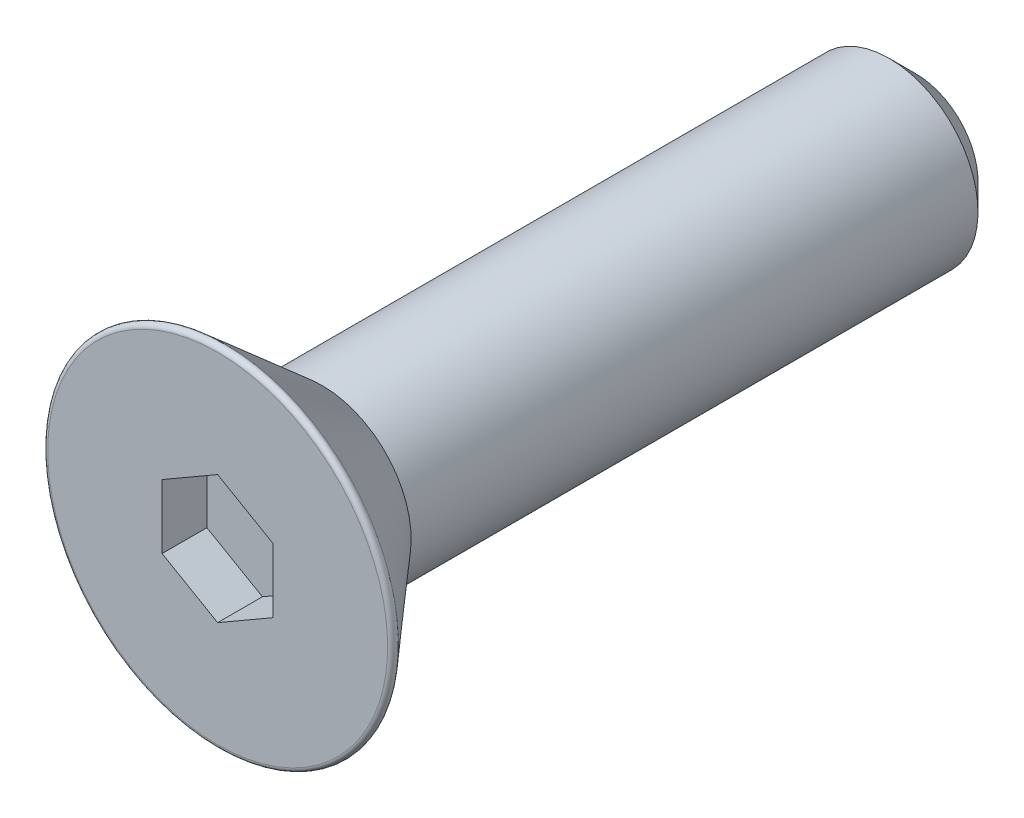
ISO-10303-21;
HEADER;
FILE_DESCRIPTION(('STEP AP214'),'2;1');
FILE_NAME('part.step','',(''),(''),'','','');
FILE_SCHEMA(('AUTOMOTIVE_DESIGN { 1 0 10303 214 1 1 1 1 }'));
ENDSEC;
DATA;
#1=APPLICATION_CONTEXT('core data for automotive mechanical design processes');
#2=APPLICATION_PROTOCOL_DEFINITION('international standard','automotive_design',2000,#1);
#3=PRODUCT_CONTEXT('',#1,'mechanical');
#4=PRODUCT('Part','Part','',(#3));
#5=PRODUCT_RELATED_PRODUCT_CATEGORY('part','',(#4));
#6=PRODUCT_DEFINITION_FORMATION('','',#4);
#7=PRODUCT_DEFINITION_CONTEXT('part definition',#1,'design');
#8=PRODUCT_DEFINITION('design','',#6,#7);
#9=PRODUCT_DEFINITION_SHAPE('','',#8);
#10=(LENGTH_UNIT() NAMED_UNIT(*) SI_UNIT(.MILLI.,.METRE.));
#11=(NAMED_UNIT(*) PLANE_ANGLE_UNIT() SI_UNIT($,.RADIAN.));
#12=(NAMED_UNIT(*) SI_UNIT($,.STERADIAN.) SOLID_ANGLE_UNIT());
#13=UNCERTAINTY_MEASURE_WITH_UNIT(LENGTH_MEASURE(1.E-05),#10,'distance_accuracy_value','');
#14=(GEOMETRIC_REPRESENTATION_CONTEXT(3) GLOBAL_UNCERTAINTY_ASSIGNED_CONTEXT((#13)) GLOBAL_UNIT_ASSIGNED_CONTEXT((#10,
#11,#12)) REPRESENTATION_CONTEXT('',''));
#15=CARTESIAN_POINT('',(0.,0.,0.));
#16=DIRECTION('',(0.,0.,1.));
#17=DIRECTION('',(1.,0.,0.));
#18=AXIS2_PLACEMENT_3D('',#15,#16,#17);
#19=CARTESIAN_POINT('',(0.,0.,8.51289226515041));
#20=DIRECTION('',(0.,0.,1.));
#21=DIRECTION('',(0.,-1.,0.));
#22=AXIS2_PLACEMENT_3D('',#19,#20,#21);
#23=CONICAL_SURFACE('',#22,3.17500000000001,0.715584993317677);
#24=CARTESIAN_POINT('',(0.,0.,11.9882962524221));
#25=DIRECTION('',(0.,0.,-1.));
#26=DIRECTION('',(0.,1.,0.));
#27=AXIS2_PLACEMENT_3D('',#24,#25,#26);
#28=CIRCLE('',#27,6.19612259468891);
#29=CARTESIAN_POINT('',(0.,6.19612259468891,11.9882962524221));
#30=VERTEX_POINT('',#29);
#31=EDGE_CURVE('E149',#30,#30,#28,.T.);
#32=ORIENTED_EDGE('',*,*,#31,.T.);
#33=EDGE_LOOP('',(#32));
#34=FACE_BOUND('',#33,.T.);
#35=CARTESIAN_POINT('',(0.,0.,8.51289226515041));
#36=DIRECTION('',(0.,0.,-1.));
#37=DIRECTION('',(0.,1.,0.));
#38=AXIS2_PLACEMENT_3D('',#35,#36,#37);
#39=CIRCLE('',#38,3.17500000000001);
#40=CARTESIAN_POINT('',(0.,3.17500000000001,8.51289226515041));
#41=VERTEX_POINT('',#40);
#42=EDGE_CURVE('E51',#41,#41,#39,.T.);
#43=ORIENTED_EDGE('',*,*,#42,.F.);
#44=EDGE_LOOP('',(#43));
#45=FACE_BOUND('',#44,.T.);
#46=ADVANCED_FACE('F44',(#34,#45),#23,.T.);
#47=CARTESIAN_POINT('',(0.,2.2225,-12.7));
#48=DIRECTION('',(0.,0.,-1.));
#49=DIRECTION('',(0.,1.,0.));
#50=AXIS2_PLACEMENT_3D('',#47,#48,#49);
#51=PLANE('',#50);
#52=CARTESIAN_POINT('',(0.,0.,-12.7));
#53=DIRECTION('',(0.,0.,-1.));
#54=DIRECTION('',(0.,1.,0.));
#55=AXIS2_PLACEMENT_3D('',#52,#53,#54);
#56=CIRCLE('',#55,2.2225);
#57=CARTESIAN_POINT('',(0.,2.2225,-12.7));
#58=VERTEX_POINT('',#57);
#59=EDGE_CURVE('E158',#58,#58,#56,.T.);
#60=ORIENTED_EDGE('',*,*,#59,.T.);
#61=EDGE_LOOP('',(#60));
#62=FACE_BOUND('',#61,.T.);
#63=ADVANCED_FACE('F181',(#62),#51,.T.);
#64=CARTESIAN_POINT('',(0.,0.,-12.7));
#65=DIRECTION('',(0.,0.,1.));
#66=DIRECTION('',(0.,-1.,0.));
#67=AXIS2_PLACEMENT_3D('',#64,#65,#66);
#68=CONICAL_SURFACE('',#67,2.2225,0.785398163397453);
#69=CARTESIAN_POINT('',(0.,0.,-11.7475));
#70=DIRECTION('',(0.,0.,-1.));
#71=DIRECTION('',(0.,1.,0.));
#72=AXIS2_PLACEMENT_3D('',#69,#70,#71);
#73=CIRCLE('',#72,3.17500000000001);
#74=CARTESIAN_POINT('',(0.,3.17500000000001,-11.7475));
#75=VERTEX_POINT('',#74);
#76=EDGE_CURVE('E104',#75,#75,#73,.T.);
#77=ORIENTED_EDGE('',*,*,#76,.T.);
#78=EDGE_LOOP('',(#77));
#79=FACE_BOUND('',#78,.T.);
#80=ORIENTED_EDGE('',*,*,#59,.F.);
#81=EDGE_LOOP('',(#80));
#82=FACE_BOUND('',#81,.T.);
#83=ADVANCED_FACE('F188',(#79,#82),#68,.T.);
#84=CARTESIAN_POINT('',(0.,0.,-12.7));
#85=DIRECTION('',(0.,0.,-1.));
#86=DIRECTION('',(0.,1.,0.));
#87=AXIS2_PLACEMENT_3D('',#84,#85,#86);
#88=CYLINDRICAL_SURFACE('',#87,3.17500000000001);
#89=ORIENTED_EDGE('',*,*,#42,.T.);
#90=EDGE_LOOP('',(#89));
#91=FACE_BOUND('',#90,.T.);
#92=ORIENTED_EDGE('',*,*,#76,.F.);
#93=EDGE_LOOP('',(#92));
#94=FACE_BOUND('',#93,.T.);
#95=ADVANCED_FACE('F201',(#91,#94),#88,.T.);
#96=CARTESIAN_POINT('',(0.,6.07435083134095,12.2555));
#97=DIRECTION('',(0.,0.,-1.));
#98=DIRECTION('',(0.,1.,0.));
#99=AXIS2_PLACEMENT_3D('',#96,#97,#98);
#100=PLANE('',#99);
#101=CARTESIAN_POINT('',(0.,0.,12.2555));
#102=DIRECTION('',(0.,0.,-1.));
#103=DIRECTION('',(0.,1.,0.));
#104=AXIS2_PLACEMENT_3D('',#101,#102,#103);
#105=CIRCLE('',#104,6.07435083134095);
#106=CARTESIAN_POINT('',(0.,6.07435083134095,12.2555));
#107=VERTEX_POINT('',#106);
#108=EDGE_CURVE('E144',#107,#107,#105,.T.);
#109=ORIENTED_EDGE('',*,*,#108,.F.);
#110=EDGE_LOOP('',(#109));
#111=FACE_BOUND('',#110,.T.);
#112=DIRECTION('',(0.866025403784439,-0.5,0.));
#113=VECTOR('',#112,1.);
#114=CARTESIAN_POINT('',(-1.984375,-1.14567944042316,12.2555));
#115=LINE('',#114,#113);
#116=CARTESIAN_POINT('',(-1.984375,-1.14567944042316,12.2555));
#117=VERTEX_POINT('',#116);
#118=CARTESIAN_POINT('',(0.,-2.29135888084633,12.2555));
#119=VERTEX_POINT('',#118);
#120=EDGE_CURVE('E105',#117,#119,#115,.T.);
#121=ORIENTED_EDGE('',*,*,#120,.F.);
#122=DIRECTION('',(0.,-1.,0.));
#123=VECTOR('',#122,1.);
#124=CARTESIAN_POINT('',(-1.984375,1.14567944042316,12.2555));
#125=LINE('',#124,#123);
#126=CARTESIAN_POINT('',(-1.984375,1.14567944042316,12.2555));
#127=VERTEX_POINT('',#126);
#128=EDGE_CURVE('E146',#127,#117,#125,.T.);
#129=ORIENTED_EDGE('',*,*,#128,.F.);
#130=DIRECTION('',(-0.866025403784439,-0.5,0.));
#131=VECTOR('',#130,1.);
#132=CARTESIAN_POINT('',(0.,2.29135888084633,12.2555));
#133=LINE('',#132,#131);
#134=CARTESIAN_POINT('',(0.,2.29135888084633,12.2555));
#135=VERTEX_POINT('',#134);
#136=EDGE_CURVE('E136',#135,#127,#133,.T.);
#137=ORIENTED_EDGE('',*,*,#136,.F.);
#138=DIRECTION('',(-0.866025403784439,0.5,0.));
#139=VECTOR('',#138,1.);
#140=CARTESIAN_POINT('',(1.984375,1.14567944042316,12.2555));
#141=LINE('',#140,#139);
#142=CARTESIAN_POINT('',(1.984375,1.14567944042316,12.2555));
#143=VERTEX_POINT('',#142);
#144=EDGE_CURVE('E58',#143,#135,#141,.T.);
#145=ORIENTED_EDGE('',*,*,#144,.F.);
#146=DIRECTION('',(0.,1.,0.));
#147=VECTOR('',#146,1.);
#148=CARTESIAN_POINT('',(1.984375,-1.14567944042316,12.2555));
#149=LINE('',#148,#147);
#150=CARTESIAN_POINT('',(1.984375,-1.14567944042316,12.2555));
#151=VERTEX_POINT('',#150);
#152=EDGE_CURVE('E12',#151,#143,#149,.T.);
#153=ORIENTED_EDGE('',*,*,#152,.F.);
#154=DIRECTION('',(0.866025403784439,0.5,0.));
#155=VECTOR('',#154,1.);
#156=CARTESIAN_POINT('',(0.,-2.29135888084633,12.2555));
#157=LINE('',#156,#155);
#158=EDGE_CURVE('E96',#119,#151,#157,.T.);
#159=ORIENTED_EDGE('',*,*,#158,.F.);
#160=EDGE_LOOP('',(#121,#129,#137,#145,#153,#159));
#161=FACE_BOUND('',#160,.T.);
#162=ADVANCED_FACE('F95',(#111,#161),#100,.F.);
#163=CARTESIAN_POINT('',(0.,0.,12.094150831341));
#164=DIRECTION('',(0.,0.,-1.));
#165=DIRECTION('',(0.,1.,0.));
#166=AXIS2_PLACEMENT_3D('',#163,#164,#165);
#167=TOROIDAL_SURFACE('',#166,6.07435083134095,0.161349168659044);
#168=ORIENTED_EDGE('',*,*,#31,.F.);
#169=EDGE_LOOP('',(#168));
#170=FACE_BOUND('',#169,.T.);
#171=ORIENTED_EDGE('',*,*,#108,.T.);
#172=EDGE_LOOP('',(#171));
#173=FACE_BOUND('',#172,.T.);
#174=ADVANCED_FACE('F195',(#170,#173),#167,.T.);
#175=CARTESIAN_POINT('',(0.,0.,10.6553));
#176=DIRECTION('',(0.,0.,1.));
#177=DIRECTION('',(1.,0.,0.));
#178=AXIS2_PLACEMENT_3D('',#175,#176,#177);
#179=PLANE('',#178);
#180=DIRECTION('',(0.866025403784439,0.5,0.));
#181=VECTOR('',#180,1.);
#182=CARTESIAN_POINT('',(0.,-2.29135888084633,10.6553));
#183=LINE('',#182,#181);
#184=CARTESIAN_POINT('',(0.,-2.29135888084633,10.6553));
#185=VERTEX_POINT('',#184);
#186=CARTESIAN_POINT('',(1.984375,-1.14567944042316,10.6553));
#187=VERTEX_POINT('',#186);
#188=EDGE_CURVE('E161',#185,#187,#183,.T.);
#189=ORIENTED_EDGE('',*,*,#188,.T.);
#190=DIRECTION('',(0.,1.,0.));
#191=VECTOR('',#190,1.);
#192=CARTESIAN_POINT('',(1.984375,-1.14567944042316,10.6553));
#193=LINE('',#192,#191);
#194=CARTESIAN_POINT('',(1.984375,1.14567944042316,10.6553));
#195=VERTEX_POINT('',#194);
#196=EDGE_CURVE('E109',#187,#195,#193,.T.);
#197=ORIENTED_EDGE('',*,*,#196,.T.);
#198=DIRECTION('',(-0.866025403784439,0.5,0.));
#199=VECTOR('',#198,1.);
#200=CARTESIAN_POINT('',(1.984375,1.14567944042316,10.6553));
#201=LINE('',#200,#199);
#202=CARTESIAN_POINT('',(0.,2.29135888084633,10.6553));
#203=VERTEX_POINT('',#202);
#204=EDGE_CURVE('E143',#195,#203,#201,.T.);
#205=ORIENTED_EDGE('',*,*,#204,.T.);
#206=DIRECTION('',(-0.866025403784439,-0.5,0.));
#207=VECTOR('',#206,1.);
#208=CARTESIAN_POINT('',(0.,2.29135888084633,10.6553));
#209=LINE('',#208,#207);
#210=CARTESIAN_POINT('',(-1.984375,1.14567944042316,10.6553));
#211=VERTEX_POINT('',#210);
#212=EDGE_CURVE('E138',#203,#211,#209,.T.);
#213=ORIENTED_EDGE('',*,*,#212,.T.);
#214=DIRECTION('',(0.,-1.,0.));
#215=VECTOR('',#214,1.);
#216=CARTESIAN_POINT('',(-1.984375,1.14567944042316,10.6553));
#217=LINE('',#216,#215);
#218=CARTESIAN_POINT('',(-1.984375,-1.14567944042316,10.6553));
#219=VERTEX_POINT('',#218);
#220=EDGE_CURVE('E117',#211,#219,#217,.T.);
#221=ORIENTED_EDGE('',*,*,#220,.T.);
#222=DIRECTION('',(0.866025403784439,-0.5,0.));
#223=VECTOR('',#222,1.);
#224=CARTESIAN_POINT('',(-1.984375,-1.14567944042316,10.6553));
#225=LINE('',#224,#223);
#226=EDGE_CURVE('E112',#219,#185,#225,.T.);
#227=ORIENTED_EDGE('',*,*,#226,.T.);
#228=EDGE_LOOP('',(#189,#197,#205,#213,#221,#227));
#229=FACE_BOUND('',#228,.T.);
#230=ADVANCED_FACE('F168',(#229),#179,.T.);
#231=CARTESIAN_POINT('',(1.984375,-1.14567944042316,10.6553));
#232=DIRECTION('',(1.,0.,0.));
#233=DIRECTION('',(0.,1.,0.));
#234=AXIS2_PLACEMENT_3D('',#231,#232,#233);
#235=PLANE('',#234);
#236=DIRECTION('',(0.,0.,1.));
#237=VECTOR('',#236,1.);
#238=CARTESIAN_POINT('',(1.984375,-1.14567944042316,10.6553));
#239=LINE('',#238,#237);
#240=EDGE_CURVE('E102',#187,#151,#239,.T.);
#241=ORIENTED_EDGE('',*,*,#240,.T.);
#242=ORIENTED_EDGE('',*,*,#152,.T.);
#243=DIRECTION('',(0.,0.,1.));
#244=VECTOR('',#243,1.);
#245=CARTESIAN_POINT('',(1.984375,1.14567944042316,10.6553));
#246=LINE('',#245,#244);
#247=EDGE_CURVE('E111',#195,#143,#246,.T.);
#248=ORIENTED_EDGE('',*,*,#247,.F.);
#249=ORIENTED_EDGE('',*,*,#196,.F.);
#250=EDGE_LOOP('',(#241,#242,#248,#249));
#251=FACE_BOUND('',#250,.T.);
#252=ADVANCED_FACE('F107',(#251),#235,.F.);
#253=CARTESIAN_POINT('',(1.984375,1.14567944042316,10.6553));
#254=DIRECTION('',(0.5,0.866025403784439,0.));
#255=DIRECTION('',(-0.866025403784439,0.5,0.));
#256=AXIS2_PLACEMENT_3D('',#253,#254,#255);
#257=PLANE('',#256);
#258=ORIENTED_EDGE('',*,*,#247,.T.);
#259=ORIENTED_EDGE('',*,*,#144,.T.);
#260=DIRECTION('',(0.,0.,1.));
#261=VECTOR('',#260,1.);
#262=CARTESIAN_POINT('',(0.,2.29135888084633,10.6553));
#263=LINE('',#262,#261);
#264=EDGE_CURVE('E114',#203,#135,#263,.T.);
#265=ORIENTED_EDGE('',*,*,#264,.F.);
#266=ORIENTED_EDGE('',*,*,#204,.F.);
#267=EDGE_LOOP('',(#258,#259,#265,#266));
#268=FACE_BOUND('',#267,.T.);
#269=ADVANCED_FACE('F142',(#268),#257,.F.);
#270=CARTESIAN_POINT('',(0.,2.29135888084633,10.6553));
#271=DIRECTION('',(-0.5,0.866025403784439,0.));
#272=DIRECTION('',(-0.866025403784439,-0.5,0.));
#273=AXIS2_PLACEMENT_3D('',#270,#271,#272);
#274=PLANE('',#273);
#275=ORIENTED_EDGE('',*,*,#264,.T.);
#276=ORIENTED_EDGE('',*,*,#136,.T.);
#277=DIRECTION('',(0.,0.,1.));
#278=VECTOR('',#277,1.);
#279=CARTESIAN_POINT('',(-1.984375,1.14567944042316,10.6553));
#280=LINE('',#279,#278);
#281=EDGE_CURVE('E126',#211,#127,#280,.T.);
#282=ORIENTED_EDGE('',*,*,#281,.F.);
#283=ORIENTED_EDGE('',*,*,#212,.F.);
#284=EDGE_LOOP('',(#275,#276,#282,#283));
#285=FACE_BOUND('',#284,.T.);
#286=ADVANCED_FACE('F135',(#285),#274,.F.);
#287=CARTESIAN_POINT('',(-1.984375,1.14567944042316,10.6553));
#288=DIRECTION('',(-1.,0.,0.));
#289=DIRECTION('',(0.,0.,1.));
#290=AXIS2_PLACEMENT_3D('',#287,#288,#289);
#291=PLANE('',#290);
#292=ORIENTED_EDGE('',*,*,#281,.T.);
#293=ORIENTED_EDGE('',*,*,#128,.T.);
#294=DIRECTION('',(0.,0.,1.));
#295=VECTOR('',#294,1.);
#296=CARTESIAN_POINT('',(-1.984375,-1.14567944042316,10.6553));
#297=LINE('',#296,#295);
#298=EDGE_CURVE('E123',#219,#117,#297,.T.);
#299=ORIENTED_EDGE('',*,*,#298,.F.);
#300=ORIENTED_EDGE('',*,*,#220,.F.);
#301=EDGE_LOOP('',(#292,#293,#299,#300));
#302=FACE_BOUND('',#301,.T.);
#303=ADVANCED_FACE('F171',(#302),#291,.F.);
#304=CARTESIAN_POINT('',(-1.984375,-1.14567944042316,10.6553));
#305=DIRECTION('',(-0.5,-0.866025403784439,0.));
#306=DIRECTION('',(0.866025403784439,-0.5,0.));
#307=AXIS2_PLACEMENT_3D('',#304,#305,#306);
#308=PLANE('',#307);
#309=ORIENTED_EDGE('',*,*,#298,.T.);
#310=ORIENTED_EDGE('',*,*,#120,.T.);
#311=DIRECTION('',(0.,0.,1.));
#312=VECTOR('',#311,1.);
#313=CARTESIAN_POINT('',(0.,-2.29135888084633,10.6553));
#314=LINE('',#313,#312);
#315=EDGE_CURVE('E65',#185,#119,#314,.T.);
#316=ORIENTED_EDGE('',*,*,#315,.F.);
#317=ORIENTED_EDGE('',*,*,#226,.F.);
#318=EDGE_LOOP('',(#309,#310,#316,#317));
#319=FACE_BOUND('',#318,.T.);
#320=ADVANCED_FACE('F170',(#319),#308,.F.);
#321=CARTESIAN_POINT('',(0.,-2.29135888084633,10.6553));
#322=DIRECTION('',(0.5,-0.866025403784439,0.));
#323=DIRECTION('',(0.866025403784439,0.5,0.));
#324=AXIS2_PLACEMENT_3D('',#321,#322,#323);
#325=PLANE('',#324);
#326=ORIENTED_EDGE('',*,*,#315,.T.);
#327=ORIENTED_EDGE('',*,*,#158,.T.);
#328=ORIENTED_EDGE('',*,*,#240,.F.);
#329=ORIENTED_EDGE('',*,*,#188,.F.);
#330=EDGE_LOOP('',(#326,#327,#328,#329));
#331=FACE_BOUND('',#330,.T.);
#332=ADVANCED_FACE('F101',(#331),#325,.F.);
#333=CLOSED_SHELL('',(#46,#63,#83,#95,#162,#174,#230,#252,#269,#286,#303,#320,#332));
#334=MANIFOLD_SOLID_BREP('B2',#333);
#335=ADVANCED_BREP_SHAPE_REPRESENTATION('',(#18,#334),#14);
#336=SHAPE_DEFINITION_REPRESENTATION(#9,#335);
ENDSEC;
END-ISO-10303-21;
